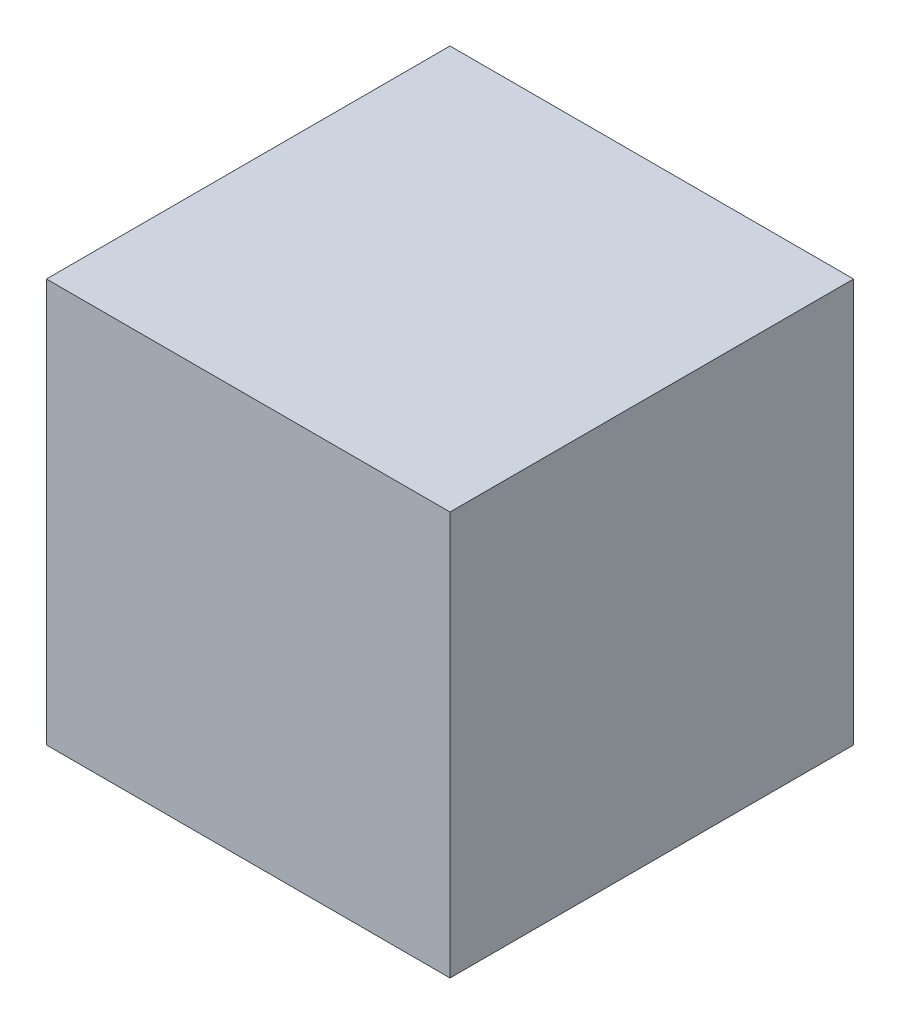
ISO-10303-21;
HEADER;
FILE_DESCRIPTION(('STEP AP214'),'2;1');
FILE_NAME('part.step','',(''),(''),'','','');
FILE_SCHEMA(('AUTOMOTIVE_DESIGN { 1 0 10303 214 1 1 1 1 }'));
ENDSEC;
DATA;
#1=APPLICATION_CONTEXT('core data for automotive mechanical design processes');
#2=APPLICATION_PROTOCOL_DEFINITION('international standard','automotive_design',2000,#1);
#3=PRODUCT_CONTEXT('',#1,'mechanical');
#4=PRODUCT('Part','Part','',(#3));
#5=PRODUCT_RELATED_PRODUCT_CATEGORY('part','',(#4));
#6=PRODUCT_DEFINITION_FORMATION('','',#4);
#7=PRODUCT_DEFINITION_CONTEXT('part definition',#1,'design');
#8=PRODUCT_DEFINITION('design','',#6,#7);
#9=PRODUCT_DEFINITION_SHAPE('','',#8);
#10=(LENGTH_UNIT() NAMED_UNIT(*) SI_UNIT(.MILLI.,.METRE.));
#11=(NAMED_UNIT(*) PLANE_ANGLE_UNIT() SI_UNIT($,.RADIAN.));
#12=(NAMED_UNIT(*) SI_UNIT($,.STERADIAN.) SOLID_ANGLE_UNIT());
#13=UNCERTAINTY_MEASURE_WITH_UNIT(LENGTH_MEASURE(1.E-05),#10,'distance_accuracy_value','');
#14=(GEOMETRIC_REPRESENTATION_CONTEXT(3) GLOBAL_UNCERTAINTY_ASSIGNED_CONTEXT((#13)) GLOBAL_UNIT_ASSIGNED_CONTEXT((#10,
#11,#12)) REPRESENTATION_CONTEXT('',''));
#15=CARTESIAN_POINT('',(0.,0.,0.));
#16=DIRECTION('',(0.,0.,1.));
#17=DIRECTION('',(1.,0.,0.));
#18=AXIS2_PLACEMENT_3D('',#15,#16,#17);
#19=CARTESIAN_POINT('',(152.4,-152.4,-304.8));
#20=DIRECTION('',(1.,0.,0.));
#21=DIRECTION('',(0.,0.,-1.));
#22=AXIS2_PLACEMENT_3D('',#19,#20,#21);
#23=PLANE('',#22);
#24=DIRECTION('',(0.,1.,0.));
#25=VECTOR('',#24,1.);
#26=CARTESIAN_POINT('',(152.4,-152.4,0.));
#27=LINE('',#26,#25);
#28=CARTESIAN_POINT('',(152.4,-152.4,0.));
#29=VERTEX_POINT('',#28);
#30=CARTESIAN_POINT('',(152.4,152.4,0.));
#31=VERTEX_POINT('',#30);
#32=EDGE_CURVE('E109',#29,#31,#27,.T.);
#33=ORIENTED_EDGE('',*,*,#32,.F.);
#34=DIRECTION('',(0.,0.,1.));
#35=VECTOR('',#34,1.);
#36=CARTESIAN_POINT('',(152.4,-152.4,-304.8));
#37=LINE('',#36,#35);
#38=CARTESIAN_POINT('',(152.4,-152.4,-304.8));
#39=VERTEX_POINT('',#38);
#40=EDGE_CURVE('E11',#39,#29,#37,.T.);
#41=ORIENTED_EDGE('',*,*,#40,.F.);
#42=DIRECTION('',(0.,1.,0.));
#43=VECTOR('',#42,1.);
#44=CARTESIAN_POINT('',(152.4,-152.4,-304.8));
#45=LINE('',#44,#43);
#46=CARTESIAN_POINT('',(152.4,152.4,-304.8));
#47=VERTEX_POINT('',#46);
#48=EDGE_CURVE('E101',#39,#47,#45,.T.);
#49=ORIENTED_EDGE('',*,*,#48,.T.);
#50=DIRECTION('',(0.,0.,1.));
#51=VECTOR('',#50,1.);
#52=CARTESIAN_POINT('',(152.4,152.4,-304.8));
#53=LINE('',#52,#51);
#54=EDGE_CURVE('E42',#47,#31,#53,.T.);
#55=ORIENTED_EDGE('',*,*,#54,.T.);
#56=EDGE_LOOP('',(#33,#41,#49,#55));
#57=FACE_BOUND('',#56,.T.);
#58=ADVANCED_FACE('F39',(#57),#23,.T.);
#59=CARTESIAN_POINT('',(-152.4,-152.4,-304.8));
#60=DIRECTION('',(0.,-1.,0.));
#61=DIRECTION('',(0.,0.,-1.));
#62=AXIS2_PLACEMENT_3D('',#59,#60,#61);
#63=PLANE('',#62);
#64=DIRECTION('',(1.,0.,0.));
#65=VECTOR('',#64,1.);
#66=CARTESIAN_POINT('',(-152.4,-152.4,0.));
#67=LINE('',#66,#65);
#68=CARTESIAN_POINT('',(-152.4,-152.4,0.));
#69=VERTEX_POINT('',#68);
#70=EDGE_CURVE('E104',#69,#29,#67,.T.);
#71=ORIENTED_EDGE('',*,*,#70,.F.);
#72=DIRECTION('',(0.,0.,1.));
#73=VECTOR('',#72,1.);
#74=CARTESIAN_POINT('',(-152.4,-152.4,-304.8));
#75=LINE('',#74,#73);
#76=CARTESIAN_POINT('',(-152.4,-152.4,-304.8));
#77=VERTEX_POINT('',#76);
#78=EDGE_CURVE('E49',#77,#69,#75,.T.);
#79=ORIENTED_EDGE('',*,*,#78,.F.);
#80=DIRECTION('',(1.,0.,0.));
#81=VECTOR('',#80,1.);
#82=CARTESIAN_POINT('',(-152.4,-152.4,-304.8));
#83=LINE('',#82,#81);
#84=EDGE_CURVE('E96',#77,#39,#83,.T.);
#85=ORIENTED_EDGE('',*,*,#84,.T.);
#86=ORIENTED_EDGE('',*,*,#40,.T.);
#87=EDGE_LOOP('',(#71,#79,#85,#86));
#88=FACE_BOUND('',#87,.T.);
#89=ADVANCED_FACE('F125',(#88),#63,.T.);
#90=CARTESIAN_POINT('',(-152.4,-152.4,-304.8));
#91=DIRECTION('',(-1.,0.,0.));
#92=DIRECTION('',(0.,0.,1.));
#93=AXIS2_PLACEMENT_3D('',#90,#91,#92);
#94=PLANE('',#93);
#95=DIRECTION('',(0.,-1.,0.));
#96=VECTOR('',#95,1.);
#97=CARTESIAN_POINT('',(-152.4,-152.4,0.));
#98=LINE('',#97,#96);
#99=CARTESIAN_POINT('',(-152.4,152.4,0.));
#100=VERTEX_POINT('',#99);
#101=EDGE_CURVE('E90',#100,#69,#98,.T.);
#102=ORIENTED_EDGE('',*,*,#101,.F.);
#103=DIRECTION('',(0.,0.,1.));
#104=VECTOR('',#103,1.);
#105=CARTESIAN_POINT('',(-152.4,152.4,-304.8));
#106=LINE('',#105,#104);
#107=CARTESIAN_POINT('',(-152.4,152.4,-304.8));
#108=VERTEX_POINT('',#107);
#109=EDGE_CURVE('E85',#108,#100,#106,.T.);
#110=ORIENTED_EDGE('',*,*,#109,.F.);
#111=DIRECTION('',(0.,-1.,0.));
#112=VECTOR('',#111,1.);
#113=CARTESIAN_POINT('',(-152.4,-152.4,-304.8));
#114=LINE('',#113,#112);
#115=EDGE_CURVE('E88',#108,#77,#114,.T.);
#116=ORIENTED_EDGE('',*,*,#115,.T.);
#117=ORIENTED_EDGE('',*,*,#78,.T.);
#118=EDGE_LOOP('',(#102,#110,#116,#117));
#119=FACE_BOUND('',#118,.T.);
#120=ADVANCED_FACE('F87',(#119),#94,.T.);
#121=CARTESIAN_POINT('',(-152.4,152.4,-304.8));
#122=DIRECTION('',(0.,1.,0.));
#123=DIRECTION('',(0.,0.,1.));
#124=AXIS2_PLACEMENT_3D('',#121,#122,#123);
#125=PLANE('',#124);
#126=DIRECTION('',(-1.,0.,0.));
#127=VECTOR('',#126,1.);
#128=CARTESIAN_POINT('',(-152.4,152.4,0.));
#129=LINE('',#128,#127);
#130=EDGE_CURVE('E113',#31,#100,#129,.T.);
#131=ORIENTED_EDGE('',*,*,#130,.F.);
#132=ORIENTED_EDGE('',*,*,#54,.F.);
#133=DIRECTION('',(-1.,0.,0.));
#134=VECTOR('',#133,1.);
#135=CARTESIAN_POINT('',(-152.4,152.4,-304.8));
#136=LINE('',#135,#134);
#137=EDGE_CURVE('E95',#47,#108,#136,.T.);
#138=ORIENTED_EDGE('',*,*,#137,.T.);
#139=ORIENTED_EDGE('',*,*,#109,.T.);
#140=EDGE_LOOP('',(#131,#132,#138,#139));
#141=FACE_BOUND('',#140,.T.);
#142=ADVANCED_FACE('F99',(#141),#125,.T.);
#143=CARTESIAN_POINT('',(0.,0.,-304.8));
#144=DIRECTION('',(0.,0.,-1.));
#145=DIRECTION('',(-1.,0.,0.));
#146=AXIS2_PLACEMENT_3D('',#143,#144,#145);
#147=PLANE('',#146);
#148=ORIENTED_EDGE('',*,*,#48,.F.);
#149=ORIENTED_EDGE('',*,*,#84,.F.);
#150=ORIENTED_EDGE('',*,*,#115,.F.);
#151=ORIENTED_EDGE('',*,*,#137,.F.);
#152=EDGE_LOOP('',(#148,#149,#150,#151));
#153=FACE_BOUND('',#152,.T.);
#154=ADVANCED_FACE('F94',(#153),#147,.T.);
#155=CARTESIAN_POINT('',(0.,0.,0.));
#156=DIRECTION('',(0.,0.,-1.));
#157=DIRECTION('',(-1.,0.,0.));
#158=AXIS2_PLACEMENT_3D('',#155,#156,#157);
#159=PLANE('',#158);
#160=ORIENTED_EDGE('',*,*,#32,.T.);
#161=ORIENTED_EDGE('',*,*,#130,.T.);
#162=ORIENTED_EDGE('',*,*,#101,.T.);
#163=ORIENTED_EDGE('',*,*,#70,.T.);
#164=EDGE_LOOP('',(#160,#161,#162,#163));
#165=FACE_BOUND('',#164,.T.);
#166=ADVANCED_FACE('F124',(#165),#159,.F.);
#167=CLOSED_SHELL('',(#58,#89,#120,#142,#154,#166));
#168=MANIFOLD_SOLID_BREP('B2',#167);
#169=ADVANCED_BREP_SHAPE_REPRESENTATION('',(#18,#168),#14);
#170=SHAPE_DEFINITION_REPRESENTATION(#9,#169);
ENDSEC;
END-ISO-10303-21;
